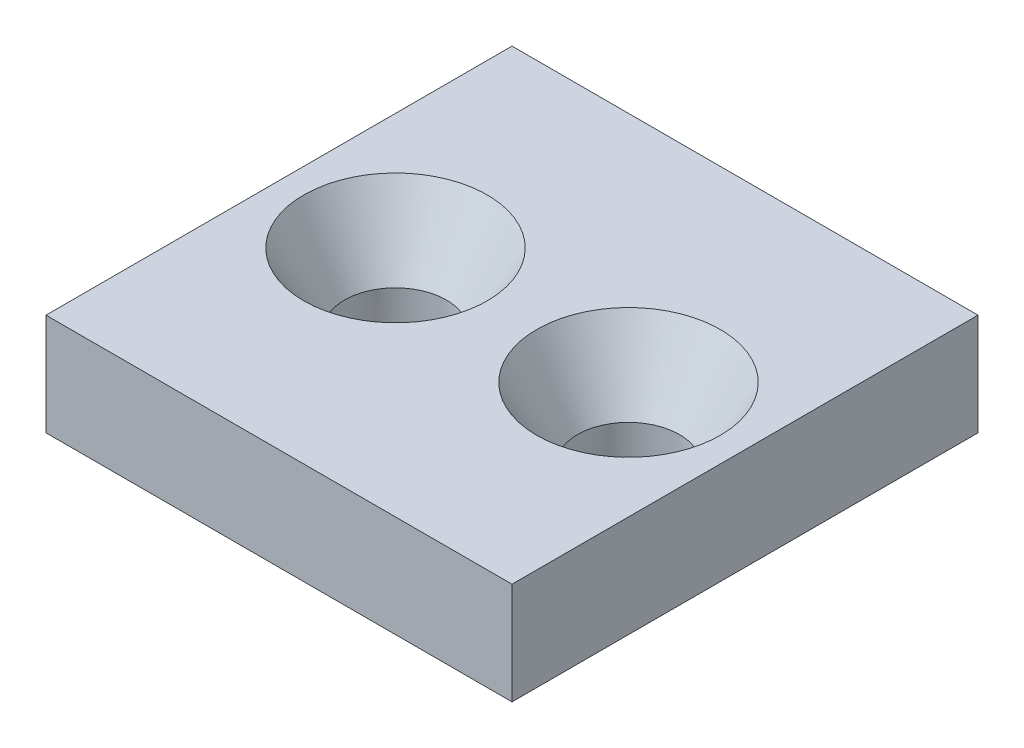
ISO-10303-21;
HEADER;
FILE_DESCRIPTION(('STEP AP214'),'2;1');
FILE_NAME('part.step','',(''),(''),'','','');
FILE_SCHEMA(('AUTOMOTIVE_DESIGN { 1 0 10303 214 1 1 1 1 }'));
ENDSEC;
DATA;
#1=APPLICATION_CONTEXT('core data for automotive mechanical design processes');
#2=APPLICATION_PROTOCOL_DEFINITION('international standard','automotive_design',2000,#1);
#3=PRODUCT_CONTEXT('',#1,'mechanical');
#4=PRODUCT('Part','Part','',(#3));
#5=PRODUCT_RELATED_PRODUCT_CATEGORY('part','',(#4));
#6=PRODUCT_DEFINITION_FORMATION('','',#4);
#7=PRODUCT_DEFINITION_CONTEXT('part definition',#1,'design');
#8=PRODUCT_DEFINITION('design','',#6,#7);
#9=PRODUCT_DEFINITION_SHAPE('','',#8);
#10=(LENGTH_UNIT() NAMED_UNIT(*) SI_UNIT(.MILLI.,.METRE.));
#11=(NAMED_UNIT(*) PLANE_ANGLE_UNIT() SI_UNIT($,.RADIAN.));
#12=(NAMED_UNIT(*) SI_UNIT($,.STERADIAN.) SOLID_ANGLE_UNIT());
#13=UNCERTAINTY_MEASURE_WITH_UNIT(LENGTH_MEASURE(1.E-05),#10,'distance_accuracy_value','');
#14=(GEOMETRIC_REPRESENTATION_CONTEXT(3) GLOBAL_UNCERTAINTY_ASSIGNED_CONTEXT((#13)) GLOBAL_UNIT_ASSIGNED_CONTEXT((#10,
#11,#12)) REPRESENTATION_CONTEXT('',''));
#15=CARTESIAN_POINT('',(0.,0.,0.));
#16=DIRECTION('',(0.,0.,1.));
#17=DIRECTION('',(1.,0.,0.));
#18=AXIS2_PLACEMENT_3D('',#15,#16,#17);
#19=CARTESIAN_POINT('',(0.,7.,0.));
#20=DIRECTION('',(0.,-1.,0.));
#21=DIRECTION('',(0.,0.,-1.));
#22=AXIS2_PLACEMENT_3D('',#19,#20,#21);
#23=PLANE('',#22);
#24=DIRECTION('',(0.,0.,-1.));
#25=VECTOR('',#24,1.);
#26=CARTESIAN_POINT('',(16.,7.,16.));
#27=LINE('',#26,#25);
#28=CARTESIAN_POINT('',(16.,7.,16.));
#29=VERTEX_POINT('',#28);
#30=CARTESIAN_POINT('',(16.,7.,-16.));
#31=VERTEX_POINT('',#30);
#32=EDGE_CURVE('E96',#29,#31,#27,.T.);
#33=ORIENTED_EDGE('',*,*,#32,.T.);
#34=DIRECTION('',(-1.,0.,0.));
#35=VECTOR('',#34,1.);
#36=CARTESIAN_POINT('',(-16.,7.,-16.));
#37=LINE('',#36,#35);
#38=CARTESIAN_POINT('',(-16.,7.,-16.));
#39=VERTEX_POINT('',#38);
#40=EDGE_CURVE('E91',#31,#39,#37,.T.);
#41=ORIENTED_EDGE('',*,*,#40,.T.);
#42=DIRECTION('',(0.,0.,1.));
#43=VECTOR('',#42,1.);
#44=CARTESIAN_POINT('',(-16.,7.,16.));
#45=LINE('',#44,#43);
#46=CARTESIAN_POINT('',(-16.,7.,16.));
#47=VERTEX_POINT('',#46);
#48=EDGE_CURVE('E94',#39,#47,#45,.T.);
#49=ORIENTED_EDGE('',*,*,#48,.T.);
#50=DIRECTION('',(1.,0.,0.));
#51=VECTOR('',#50,1.);
#52=CARTESIAN_POINT('',(-16.,7.,16.));
#53=LINE('',#52,#51);
#54=EDGE_CURVE('E61',#47,#29,#53,.T.);
#55=ORIENTED_EDGE('',*,*,#54,.T.);
#56=EDGE_LOOP('',(#33,#41,#49,#55));
#57=FACE_BOUND('',#56,.T.);
#58=CARTESIAN_POINT('',(8.,7.,0.));
#59=DIRECTION('',(0.,1.,0.));
#60=DIRECTION('',(0.,0.,1.));
#61=AXIS2_PLACEMENT_3D('',#58,#59,#60);
#62=CIRCLE('',#61,6.3);
#63=CARTESIAN_POINT('',(8.,7.,6.3));
#64=VERTEX_POINT('',#63);
#65=EDGE_CURVE('E127',#64,#64,#62,.T.);
#66=ORIENTED_EDGE('',*,*,#65,.F.);
#67=EDGE_LOOP('',(#66));
#68=FACE_BOUND('',#67,.T.);
#69=CARTESIAN_POINT('',(-8.,7.,0.));
#70=DIRECTION('',(0.,1.,0.));
#71=DIRECTION('',(0.,0.,1.));
#72=AXIS2_PLACEMENT_3D('',#69,#70,#71);
#73=CIRCLE('',#72,6.3);
#74=CARTESIAN_POINT('',(-8.,7.,6.3));
#75=VERTEX_POINT('',#74);
#76=EDGE_CURVE('E136',#75,#75,#73,.T.);
#77=ORIENTED_EDGE('',*,*,#76,.F.);
#78=EDGE_LOOP('',(#77));
#79=FACE_BOUND('',#78,.T.);
#80=ADVANCED_FACE('F44',(#57,#68,#79),#23,.F.);
#81=CARTESIAN_POINT('',(16.,7.,16.));
#82=DIRECTION('',(-1.,0.,0.));
#83=DIRECTION('',(0.,0.,1.));
#84=AXIS2_PLACEMENT_3D('',#81,#82,#83);
#85=PLANE('',#84);
#86=DIRECTION('',(0.,0.,-1.));
#87=VECTOR('',#86,1.);
#88=CARTESIAN_POINT('',(16.,0.,16.));
#89=LINE('',#88,#87);
#90=CARTESIAN_POINT('',(16.,0.,16.));
#91=VERTEX_POINT('',#90);
#92=CARTESIAN_POINT('',(16.,0.,-16.));
#93=VERTEX_POINT('',#92);
#94=EDGE_CURVE('E108',#91,#93,#89,.T.);
#95=ORIENTED_EDGE('',*,*,#94,.T.);
#96=DIRECTION('',(0.,-1.,0.));
#97=VECTOR('',#96,1.);
#98=CARTESIAN_POINT('',(16.,7.,-16.));
#99=LINE('',#98,#97);
#100=EDGE_CURVE('E13',#31,#93,#99,.T.);
#101=ORIENTED_EDGE('',*,*,#100,.F.);
#102=ORIENTED_EDGE('',*,*,#32,.F.);
#103=DIRECTION('',(0.,-1.,0.));
#104=VECTOR('',#103,1.);
#105=CARTESIAN_POINT('',(16.,7.,16.));
#106=LINE('',#105,#104);
#107=EDGE_CURVE('E104',#29,#91,#106,.T.);
#108=ORIENTED_EDGE('',*,*,#107,.T.);
#109=EDGE_LOOP('',(#95,#101,#102,#108));
#110=FACE_BOUND('',#109,.T.);
#111=ADVANCED_FACE('F46',(#110),#85,.F.);
#112=CARTESIAN_POINT('',(-16.,7.,-16.));
#113=DIRECTION('',(0.,0.,1.));
#114=DIRECTION('',(1.,0.,0.));
#115=AXIS2_PLACEMENT_3D('',#112,#113,#114);
#116=PLANE('',#115);
#117=DIRECTION('',(-1.,0.,0.));
#118=VECTOR('',#117,1.);
#119=CARTESIAN_POINT('',(-16.,0.,-16.));
#120=LINE('',#119,#118);
#121=CARTESIAN_POINT('',(-16.,0.,-16.));
#122=VERTEX_POINT('',#121);
#123=EDGE_CURVE('E100',#93,#122,#120,.T.);
#124=ORIENTED_EDGE('',*,*,#123,.T.);
#125=DIRECTION('',(0.,-1.,0.));
#126=VECTOR('',#125,1.);
#127=CARTESIAN_POINT('',(-16.,7.,-16.));
#128=LINE('',#127,#126);
#129=EDGE_CURVE('E53',#39,#122,#128,.T.);
#130=ORIENTED_EDGE('',*,*,#129,.F.);
#131=ORIENTED_EDGE('',*,*,#40,.F.);
#132=ORIENTED_EDGE('',*,*,#100,.T.);
#133=EDGE_LOOP('',(#124,#130,#131,#132));
#134=FACE_BOUND('',#133,.T.);
#135=ADVANCED_FACE('F99',(#134),#116,.F.);
#136=CARTESIAN_POINT('',(-16.,7.,16.));
#137=DIRECTION('',(1.,0.,0.));
#138=DIRECTION('',(0.,0.,-1.));
#139=AXIS2_PLACEMENT_3D('',#136,#137,#138);
#140=PLANE('',#139);
#141=DIRECTION('',(0.,0.,1.));
#142=VECTOR('',#141,1.);
#143=CARTESIAN_POINT('',(-16.,0.,16.));
#144=LINE('',#143,#142);
#145=CARTESIAN_POINT('',(-16.,0.,16.));
#146=VERTEX_POINT('',#145);
#147=EDGE_CURVE('E78',#122,#146,#144,.T.);
#148=ORIENTED_EDGE('',*,*,#147,.T.);
#149=DIRECTION('',(0.,-1.,0.));
#150=VECTOR('',#149,1.);
#151=CARTESIAN_POINT('',(-16.,7.,16.));
#152=LINE('',#151,#150);
#153=EDGE_CURVE('E101',#47,#146,#152,.T.);
#154=ORIENTED_EDGE('',*,*,#153,.F.);
#155=ORIENTED_EDGE('',*,*,#48,.F.);
#156=ORIENTED_EDGE('',*,*,#129,.T.);
#157=EDGE_LOOP('',(#148,#154,#155,#156));
#158=FACE_BOUND('',#157,.T.);
#159=ADVANCED_FACE('F102',(#158),#140,.F.);
#160=CARTESIAN_POINT('',(-16.,7.,16.));
#161=DIRECTION('',(0.,0.,-1.));
#162=DIRECTION('',(-1.,0.,0.));
#163=AXIS2_PLACEMENT_3D('',#160,#161,#162);
#164=PLANE('',#163);
#165=DIRECTION('',(1.,0.,0.));
#166=VECTOR('',#165,1.);
#167=CARTESIAN_POINT('',(-16.,0.,16.));
#168=LINE('',#167,#166);
#169=EDGE_CURVE('E84',#146,#91,#168,.T.);
#170=ORIENTED_EDGE('',*,*,#169,.T.);
#171=ORIENTED_EDGE('',*,*,#107,.F.);
#172=ORIENTED_EDGE('',*,*,#54,.F.);
#173=ORIENTED_EDGE('',*,*,#153,.T.);
#174=EDGE_LOOP('',(#170,#171,#172,#173));
#175=FACE_BOUND('',#174,.T.);
#176=ADVANCED_FACE('F116',(#175),#164,.F.);
#177=CARTESIAN_POINT('',(0.,0.,0.));
#178=DIRECTION('',(0.,-1.,0.));
#179=DIRECTION('',(0.,0.,-1.));
#180=AXIS2_PLACEMENT_3D('',#177,#178,#179);
#181=PLANE('',#180);
#182=CARTESIAN_POINT('',(-8.,0.,0.));
#183=DIRECTION('',(0.,-1.,0.));
#184=DIRECTION('',(0.,0.,-1.));
#185=AXIS2_PLACEMENT_3D('',#182,#183,#184);
#186=CIRCLE('',#185,3.5);
#187=CARTESIAN_POINT('',(-8.,0.,-3.5));
#188=VERTEX_POINT('',#187);
#189=EDGE_CURVE('E130',#188,#188,#186,.T.);
#190=ORIENTED_EDGE('',*,*,#189,.F.);
#191=EDGE_LOOP('',(#190));
#192=FACE_BOUND('',#191,.T.);
#193=CARTESIAN_POINT('',(8.,0.,0.));
#194=DIRECTION('',(0.,-1.,0.));
#195=DIRECTION('',(0.,0.,-1.));
#196=AXIS2_PLACEMENT_3D('',#193,#194,#195);
#197=CIRCLE('',#196,3.5);
#198=CARTESIAN_POINT('',(8.,0.,-3.5));
#199=VERTEX_POINT('',#198);
#200=EDGE_CURVE('E111',#199,#199,#197,.T.);
#201=ORIENTED_EDGE('',*,*,#200,.F.);
#202=EDGE_LOOP('',(#201));
#203=FACE_BOUND('',#202,.T.);
#204=ORIENTED_EDGE('',*,*,#94,.F.);
#205=ORIENTED_EDGE('',*,*,#169,.F.);
#206=ORIENTED_EDGE('',*,*,#147,.F.);
#207=ORIENTED_EDGE('',*,*,#123,.F.);
#208=EDGE_LOOP('',(#204,#205,#206,#207));
#209=FACE_BOUND('',#208,.T.);
#210=ADVANCED_FACE('F119',(#192,#203,#209),#181,.T.);
#211=CARTESIAN_POINT('',(8.,7.,0.));
#212=DIRECTION('',(0.,1.,0.));
#213=DIRECTION('',(0.,0.,1.));
#214=AXIS2_PLACEMENT_3D('',#211,#212,#213);
#215=CYLINDRICAL_SURFACE('',#214,3.5);
#216=CARTESIAN_POINT('',(8.,2.15025773880714,0.));
#217=DIRECTION('',(0.,1.,0.));
#218=DIRECTION('',(0.,0.,1.));
#219=AXIS2_PLACEMENT_3D('',#216,#217,#218);
#220=CIRCLE('',#219,3.5);
#221=CARTESIAN_POINT('',(8.,2.15025773880714,3.5));
#222=VERTEX_POINT('',#221);
#223=EDGE_CURVE('E124',#222,#222,#220,.T.);
#224=ORIENTED_EDGE('',*,*,#223,.T.);
#225=EDGE_LOOP('',(#224));
#226=FACE_BOUND('',#225,.T.);
#227=ORIENTED_EDGE('',*,*,#200,.T.);
#228=EDGE_LOOP('',(#227));
#229=FACE_BOUND('',#228,.T.);
#230=ADVANCED_FACE('F149',(#226,#229),#215,.F.);
#231=CARTESIAN_POINT('',(8.,7.,0.));
#232=DIRECTION('',(0.,1.,0.));
#233=DIRECTION('',(0.,0.,1.));
#234=AXIS2_PLACEMENT_3D('',#231,#232,#233);
#235=CONICAL_SURFACE('',#234,6.3,0.523598775598299);
#236=ORIENTED_EDGE('',*,*,#223,.F.);
#237=EDGE_LOOP('',(#236));
#238=FACE_BOUND('',#237,.T.);
#239=ORIENTED_EDGE('',*,*,#65,.T.);
#240=EDGE_LOOP('',(#239));
#241=FACE_BOUND('',#240,.T.);
#242=ADVANCED_FACE('F180',(#238,#241),#235,.F.);
#243=CARTESIAN_POINT('',(-8.,7.,0.));
#244=DIRECTION('',(0.,1.,0.));
#245=DIRECTION('',(0.,0.,1.));
#246=AXIS2_PLACEMENT_3D('',#243,#244,#245);
#247=CYLINDRICAL_SURFACE('',#246,3.5);
#248=CARTESIAN_POINT('',(-8.,2.15025773880714,0.));
#249=DIRECTION('',(0.,1.,0.));
#250=DIRECTION('',(0.,0.,1.));
#251=AXIS2_PLACEMENT_3D('',#248,#249,#250);
#252=CIRCLE('',#251,3.5);
#253=CARTESIAN_POINT('',(-8.,2.15025773880714,3.5));
#254=VERTEX_POINT('',#253);
#255=EDGE_CURVE('E133',#254,#254,#252,.T.);
#256=ORIENTED_EDGE('',*,*,#255,.T.);
#257=EDGE_LOOP('',(#256));
#258=FACE_BOUND('',#257,.T.);
#259=ORIENTED_EDGE('',*,*,#189,.T.);
#260=EDGE_LOOP('',(#259));
#261=FACE_BOUND('',#260,.T.);
#262=ADVANCED_FACE('F187',(#258,#261),#247,.F.);
#263=CARTESIAN_POINT('',(-8.,7.,0.));
#264=DIRECTION('',(0.,1.,0.));
#265=DIRECTION('',(0.,0.,1.));
#266=AXIS2_PLACEMENT_3D('',#263,#264,#265);
#267=CONICAL_SURFACE('',#266,6.3,0.523598775598299);
#268=ORIENTED_EDGE('',*,*,#255,.F.);
#269=EDGE_LOOP('',(#268));
#270=FACE_BOUND('',#269,.T.);
#271=ORIENTED_EDGE('',*,*,#76,.T.);
#272=EDGE_LOOP('',(#271));
#273=FACE_BOUND('',#272,.T.);
#274=ADVANCED_FACE('F140',(#270,#273),#267,.F.);
#275=CLOSED_SHELL('',(#80,#111,#135,#159,#176,#210,#230,#242,#262,#274));
#276=MANIFOLD_SOLID_BREP('B2',#275);
#277=ADVANCED_BREP_SHAPE_REPRESENTATION('',(#18,#276),#14);
#278=SHAPE_DEFINITION_REPRESENTATION(#9,#277);
ENDSEC;
END-ISO-10303-21;
